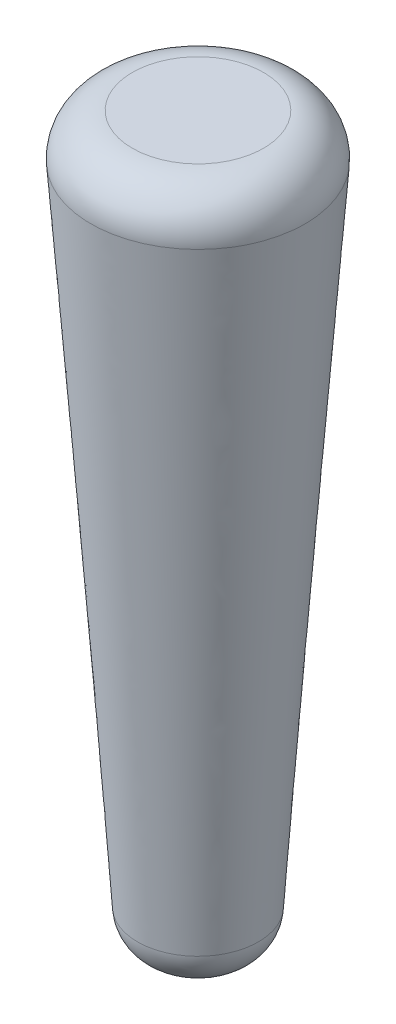
ISO-10303-21;
HEADER;
FILE_DESCRIPTION(('STEP AP214'),'2;1');
FILE_NAME('part.step','',(''),(''),'','','');
FILE_SCHEMA(('AUTOMOTIVE_DESIGN { 1 0 10303 214 1 1 1 1 }'));
ENDSEC;
DATA;
#1=APPLICATION_CONTEXT('core data for automotive mechanical design processes');
#2=APPLICATION_PROTOCOL_DEFINITION('international standard','automotive_design',2000,#1);
#3=PRODUCT_CONTEXT('',#1,'mechanical');
#4=PRODUCT('Part','Part','',(#3));
#5=PRODUCT_RELATED_PRODUCT_CATEGORY('part','',(#4));
#6=PRODUCT_DEFINITION_FORMATION('','',#4);
#7=PRODUCT_DEFINITION_CONTEXT('part definition',#1,'design');
#8=PRODUCT_DEFINITION('design','',#6,#7);
#9=PRODUCT_DEFINITION_SHAPE('','',#8);
#10=(LENGTH_UNIT() NAMED_UNIT(*) SI_UNIT(.MILLI.,.METRE.));
#11=(NAMED_UNIT(*) PLANE_ANGLE_UNIT() SI_UNIT($,.RADIAN.));
#12=(NAMED_UNIT(*) SI_UNIT($,.STERADIAN.) SOLID_ANGLE_UNIT());
#13=UNCERTAINTY_MEASURE_WITH_UNIT(LENGTH_MEASURE(1.E-05),#10,'distance_accuracy_value','');
#14=(GEOMETRIC_REPRESENTATION_CONTEXT(3) GLOBAL_UNCERTAINTY_ASSIGNED_CONTEXT((#13)) GLOBAL_UNIT_ASSIGNED_CONTEXT((#10,
#11,#12)) REPRESENTATION_CONTEXT('',''));
#15=CARTESIAN_POINT('',(0.,0.,0.));
#16=DIRECTION('',(0.,0.,1.));
#17=DIRECTION('',(1.,0.,0.));
#18=AXIS2_PLACEMENT_3D('',#15,#16,#17);
#19=CARTESIAN_POINT('',(0.,-445.008,0.));
#20=DIRECTION('',(0.,1.,0.));
#21=DIRECTION('',(0.,0.,1.));
#22=AXIS2_PLACEMENT_3D('',#19,#20,#21);
#23=PLANE('',#22);
#24=CARTESIAN_POINT('',(0.,-445.008,0.));
#25=DIRECTION('',(0.,1.,0.));
#26=DIRECTION('',(0.,0.,1.));
#27=AXIS2_PLACEMENT_3D('',#24,#25,#26);
#28=CIRCLE('',#27,11.5902267412206);
#29=CARTESIAN_POINT('',(0.,-445.008,11.5902267412206));
#30=VERTEX_POINT('',#29);
#31=EDGE_CURVE('E10',#30,#30,#28,.F.);
#32=ORIENTED_EDGE('',*,*,#31,.T.);
#33=EDGE_LOOP('',(#32));
#34=FACE_BOUND('',#33,.T.);
#35=ADVANCED_FACE('F36',(#34),#23,.F.);
#36=CARTESIAN_POINT('',(0.,0.,0.));
#37=DIRECTION('',(0.,1.,0.));
#38=DIRECTION('',(0.,0.,1.));
#39=AXIS2_PLACEMENT_3D('',#36,#37,#38);
#40=PLANE('',#39);
#41=CARTESIAN_POINT('',(0.,0.,0.));
#42=DIRECTION('',(0.,1.,0.));
#43=DIRECTION('',(0.,0.,1.));
#44=AXIS2_PLACEMENT_3D('',#41,#42,#43);
#45=CIRCLE('',#44,40.0935238759877);
#46=CARTESIAN_POINT('',(0.,0.,40.0935238759877));
#47=VERTEX_POINT('',#46);
#48=EDGE_CURVE('E51',#47,#47,#45,.T.);
#49=ORIENTED_EDGE('',*,*,#48,.T.);
#50=EDGE_LOOP('',(#49));
#51=FACE_BOUND('',#50,.T.);
#52=ADVANCED_FACE('F57',(#51),#40,.T.);
#53=CARTESIAN_POINT('',(-66.0190786927817,0.,-14.0616943700357));
#54=CARTESIAN_POINT('',(-30.5069504653579,-445.008,-17.9384249554116));
#55=CARTESIAN_POINT('',(-37.8956899527104,0.,-146.099851755599));
#56=CARTESIAN_POINT('',(5.36989944546529,-445.008,-78.9523258861275));
#57=CARTESIAN_POINT('',(94.1424674328531,0.,-117.976463015528));
#58=CARTESIAN_POINT('',(66.3838003761811,-445.008,-43.0754759753043));
#59=CARTESIAN_POINT('',(66.0190786927817,0.,14.0616943700357));
#60=CARTESIAN_POINT('',(30.5069504653579,-445.008,17.9384249554116));
#61=CARTESIAN_POINT('',(37.8956899527104,0.,146.099851755599));
#62=CARTESIAN_POINT('',(-5.36989944546528,-445.008,78.9523258861275));
#63=CARTESIAN_POINT('',(-94.1424674328531,0.,117.976463015528));
#64=CARTESIAN_POINT('',(-66.3838003761812,-445.008,43.0754759753042));
#65=CARTESIAN_POINT('',(-66.0190786927817,0.,-14.0616943700357));
#66=CARTESIAN_POINT('',(-30.5069504653579,-445.008,-17.9384249554116));
#67=(BOUNDED_SURFACE() B_SPLINE_SURFACE(3,1,((#53,#54),(#55,#56),(#57,#58),(#59,#60),(#61,#62),
(#63,#64),(#65,#66)),.UNSPECIFIED.,.T.,.F.,.F.) B_SPLINE_SURFACE_WITH_KNOTS((4,3,4),(2,2),(0.,
0.5,1.),(0.,1.),.UNSPECIFIED.) GEOMETRIC_REPRESENTATION_ITEM() RATIONAL_B_SPLINE_SURFACE(((1.,
1.),(0.333333333333333,0.333333333333333),(0.333333333333333,0.333333333333333),(1.,1.),
(0.333333333333333,0.333333333333333),(0.333333333333333,0.333333333333333),(1.,1.))) REPRESENTATION_ITEM('') SURFACE());
#68=CARTESIAN_POINT('',(0.,-27.324023295345,0.));
#69=DIRECTION('',(0.,-1.,0.));
#70=DIRECTION('',(0.,0.,-1.));
#71=AXIS2_PLACEMENT_3D('',#68,#69,#70);
#72=CIRCLE('',#71,65.4205476719051);
#73=CARTESIAN_POINT('',(-63.8385915578237,-27.324023295345,-14.2997302633782));
#74=VERTEX_POINT('',#73);
#75=EDGE_CURVE('E43',#74,#74,#72,.T.);
#76=CARTESIAN_POINT('',(0.,-421.276258571788,0.));
#77=DIRECTION('',(0.,-1.,0.));
#78=DIRECTION('',(0.,0.,-1.));
#79=AXIS2_PLACEMENT_3D('',#76,#77,#78);
#80=CIRCLE('',#79,36.9353823599509);
#81=CARTESIAN_POINT('',(-32.4007695532366,-421.276258571788,-17.7316835758432));
#82=VERTEX_POINT('',#81);
#83=EDGE_CURVE('E47',#82,#82,#80,.F.);
#84=CARTESIAN_POINT('',(-63.8385915578237,-27.324023295345,-14.2997302633782));
#85=CARTESIAN_POINT('',(-63.5111142452759,-31.427692412808,-14.3354797770497));
#86=CARTESIAN_POINT('',(-63.1836369327281,-35.5313615302709,-14.3712292907213));
#87=CARTESIAN_POINT('',(-62.5286823076326,-43.7386997651968,-14.4427283180643));
#88=CARTESIAN_POINT('',(-62.2012049950848,-47.8423688826598,-14.4784778317358));
#89=CARTESIAN_POINT('',(-61.5462503699892,-56.0497071175857,-14.5499768590788));
#90=CARTESIAN_POINT('',(-61.2187730574414,-60.1533762350486,-14.5857263727503));
#91=CARTESIAN_POINT('',(-60.5638184323459,-68.3607144699745,-14.6572254000933));
#92=CARTESIAN_POINT('',(-60.2363411197981,-72.4643835874375,-14.6929749137648));
#93=CARTESIAN_POINT('',(-59.5813864947025,-80.6717218223634,-14.7644739411079));
#94=CARTESIAN_POINT('',(-59.2539091821547,-84.7753909398263,-14.8002234547794));
#95=CARTESIAN_POINT('',(-58.5989545570592,-92.9827291747522,-14.8717224821224));
#96=CARTESIAN_POINT('',(-58.2714772445114,-97.0863982922152,-14.9074719957939));
#97=CARTESIAN_POINT('',(-57.6165226194158,-105.293736527141,-14.9789710231369));
#98=CARTESIAN_POINT('',(-57.289045306868,-109.397405644604,-15.0147205368084));
#99=CARTESIAN_POINT('',(-56.6340906817725,-117.60474387953,-15.0862195641515));
#100=CARTESIAN_POINT('',(-56.3066133692247,-121.708412996993,-15.121969077823));
#101=CARTESIAN_POINT('',(-55.6516587441291,-129.915751231919,-15.193468105166));
#102=CARTESIAN_POINT('',(-55.3241814315814,-134.019420349382,-15.2292176188375));
#103=CARTESIAN_POINT('',(-54.6692268064858,-142.226758584308,-15.3007166461805));
#104=CARTESIAN_POINT('',(-54.341749493938,-146.330427701771,-15.336466159852));
#105=CARTESIAN_POINT('',(-53.6867948688424,-154.537765936697,-15.407965187195));
#106=CARTESIAN_POINT('',(-53.3593175562947,-158.641435054159,-15.4437147008666));
#107=CARTESIAN_POINT('',(-52.7043629311991,-166.848773289085,-15.5152137282096));
#108=CARTESIAN_POINT('',(-52.3768856186513,-170.952442406548,-15.5509632418811));
#109=CARTESIAN_POINT('',(-51.7219309935558,-179.159780641474,-15.6224622692241));
#110=CARTESIAN_POINT('',(-51.394453681008,-183.263449758937,-15.6582117828956));
#111=CARTESIAN_POINT('',(-50.7394990559124,-191.470787993863,-15.7297108102386));
#112=CARTESIAN_POINT('',(-50.4120217433646,-195.574457111326,-15.7654603239101));
#113=CARTESIAN_POINT('',(-49.7570671182691,-203.781795346252,-15.8369593512532));
#114=CARTESIAN_POINT('',(-49.4295898057213,-207.885464463715,-15.8727088649247));
#115=CARTESIAN_POINT('',(-48.7746351806257,-216.092802698641,-15.9442078922677));
#116=CARTESIAN_POINT('',(-48.4471578680779,-220.196471816104,-15.9799574059392));
#117=CARTESIAN_POINT('',(-47.7922032429824,-228.40381005103,-16.0514564332822));
#118=CARTESIAN_POINT('',(-47.4647259304346,-232.507479168493,-16.0872059469537));
#119=CARTESIAN_POINT('',(-46.809771305339,-240.714817403419,-16.1587049742968));
#120=CARTESIAN_POINT('',(-46.4822939927912,-244.818486520881,-16.1944544879683));
#121=CARTESIAN_POINT('',(-45.8273393676957,-253.025824755807,-16.2659535153113));
#122=CARTESIAN_POINT('',(-45.4998620551479,-257.12949387327,-16.3017030289828));
#123=CARTESIAN_POINT('',(-44.8449074300523,-265.336832108196,-16.3732020563258));
#124=CARTESIAN_POINT('',(-44.5174301175045,-269.440501225659,-16.4089515699973));
#125=CARTESIAN_POINT('',(-43.862475492409,-277.647839460585,-16.4804505973403));
#126=CARTESIAN_POINT('',(-43.5349981798612,-281.751508578048,-16.5162001110119));
#127=CARTESIAN_POINT('',(-42.8800435547656,-289.958846812974,-16.5876991383549));
#128=CARTESIAN_POINT('',(-42.5525662422178,-294.062515930437,-16.6234486520264));
#129=CARTESIAN_POINT('',(-41.8976116171223,-302.269854165363,-16.6949476793694));
#130=CARTESIAN_POINT('',(-41.5701343045745,-306.373523282826,-16.7306971930409));
#131=CARTESIAN_POINT('',(-40.9151796794789,-314.580861517752,-16.8021962203839));
#132=CARTESIAN_POINT('',(-40.5877023669312,-318.684530635215,-16.8379457340554));
#133=CARTESIAN_POINT('',(-39.9327477418356,-326.891868870141,-16.9094447613985));
#134=CARTESIAN_POINT('',(-39.6052704292878,-330.995537987603,-16.94519427507));
#135=CARTESIAN_POINT('',(-38.9503158041922,-339.202876222529,-17.016693302413));
#136=CARTESIAN_POINT('',(-38.6228384916445,-343.306545339992,-17.0524428160845));
#137=CARTESIAN_POINT('',(-37.9678838665489,-351.513883574918,-17.1239418434275));
#138=CARTESIAN_POINT('',(-37.6404065540011,-355.617552692381,-17.159691357099));
#139=CARTESIAN_POINT('',(-36.9854519289056,-363.824890927307,-17.2311903844421));
#140=CARTESIAN_POINT('',(-36.6579746163578,-367.92856004477,-17.2669398981136));
#141=CARTESIAN_POINT('',(-36.0030199912622,-376.135898279696,-17.3384389254566));
#142=CARTESIAN_POINT('',(-35.6755426787144,-380.239567397159,-17.3741884391281));
#143=CARTESIAN_POINT('',(-35.0205880536189,-388.446905632085,-17.4456874664711));
#144=CARTESIAN_POINT('',(-34.6931107410711,-392.550574749548,-17.4814369801426));
#145=CARTESIAN_POINT('',(-34.0381561159755,-400.757912984474,-17.5529360074856));
#146=CARTESIAN_POINT('',(-33.7106788034277,-404.861582101937,-17.5886855211572));
#147=CARTESIAN_POINT('',(-33.0557241783322,-413.068920336863,-17.6601845485002));
#148=CARTESIAN_POINT('',(-32.7282468657844,-417.172589454325,-17.6959340621717));
#149=CARTESIAN_POINT('',(-32.4007695532366,-421.276258571788,-17.7316835758432));
#150=B_SPLINE_CURVE_WITH_KNOTS('',3,(#84,#85,#86,#87,#88,#89,#90,#91,#92,#93,#94,#95,#96,#97,
#98,#99,#100,#101,#102,#103,#104,#105,#106,#107,#108,#109,#110,#111,#112,#113,#114,#115,#116,
#117,#118,#119,#120,#121,#122,#123,#124,#125,#126,#127,#128,#129,#130,#131,#132,#133,#134,#135,
#136,#137,#138,#139,#140,#141,#142,#143,#144,#145,#146,#147,#148,#149),.UNSPECIFIED.,.F.,.F.,(4,
2,2,2,2,2,2,2,2,2,2,2,2,2,2,2,2,2,2,2,2,2,2,2,2,2,2,2,2,2,2,2,4),(0.,12.3506103813627,
24.7012207627254,37.0518311440881,49.4024415254508,61.7530519068135,74.1036622881762,
86.4542726695389,98.8048830509015,111.155493432264,123.506103813627,135.85671419499,
148.207324576352,160.557934957715,172.908545339078,185.25915572044,197.609766101803,
209.960376483166,222.310986864528,234.661597245891,247.012207627254,259.362818008616,
271.713428389979,284.064038771342,296.414649152704,308.765259534067,321.11586991543,
333.466480296793,345.817090678155,358.167701059518,370.518311440881,382.868921822243,
395.219532203606),.UNSPECIFIED.);
#151=EDGE_CURVE('BSEAM61',#74,#82,#150,.T.);
#152=ORIENTED_EDGE('',*,*,#75,.T.);
#153=ORIENTED_EDGE('',*,*,#83,.T.);
#154=ORIENTED_EDGE('',*,*,#151,.T.);
#155=ORIENTED_EDGE('',*,*,#151,.F.);
#156=EDGE_LOOP('',(#152,#154,#153,#155));
#157=FACE_BOUND('',#156,.T.);
#158=ADVANCED_FACE('F61',(#157),#67,.T.);
#159=CARTESIAN_POINT('',(0.,-25.4,0.));
#160=DIRECTION('',(0.,-1.,0.));
#161=DIRECTION('',(0.,0.,-1.));
#162=AXIS2_PLACEMENT_3D('',#159,#160,#161);
#163=TOROIDAL_SURFACE('',#162,40.0935238759877,25.4);
#164=ORIENTED_EDGE('',*,*,#75,.F.);
#165=EDGE_LOOP('',(#164));
#166=FACE_BOUND('',#165,.T.);
#167=ORIENTED_EDGE('',*,*,#48,.F.);
#168=EDGE_LOOP('',(#167));
#169=FACE_BOUND('',#168,.T.);
#170=ADVANCED_FACE('F59',(#166,#169),#163,.T.);
#171=CARTESIAN_POINT('',(0.,-419.608,0.));
#172=DIRECTION('',(0.,-1.,0.));
#173=DIRECTION('',(0.,0.,-1.));
#174=AXIS2_PLACEMENT_3D('',#171,#172,#173);
#175=DEGENERATE_TOROIDAL_SURFACE('',#174,11.5902267412206,25.4,.T.);
#176=ORIENTED_EDGE('',*,*,#31,.F.);
#177=EDGE_LOOP('',(#176));
#178=FACE_BOUND('',#177,.T.);
#179=ORIENTED_EDGE('',*,*,#83,.F.);
#180=EDGE_LOOP('',(#179));
#181=FACE_BOUND('',#180,.T.);
#182=ADVANCED_FACE('F38',(#178,#181),#175,.T.);
#183=CLOSED_SHELL('',(#35,#52,#158,#170,#182));
#184=MANIFOLD_SOLID_BREP('B2',#183);
#185=ADVANCED_BREP_SHAPE_REPRESENTATION('',(#18,#184),#14);
#186=SHAPE_DEFINITION_REPRESENTATION(#9,#185);
ENDSEC;
END-ISO-10303-21;
